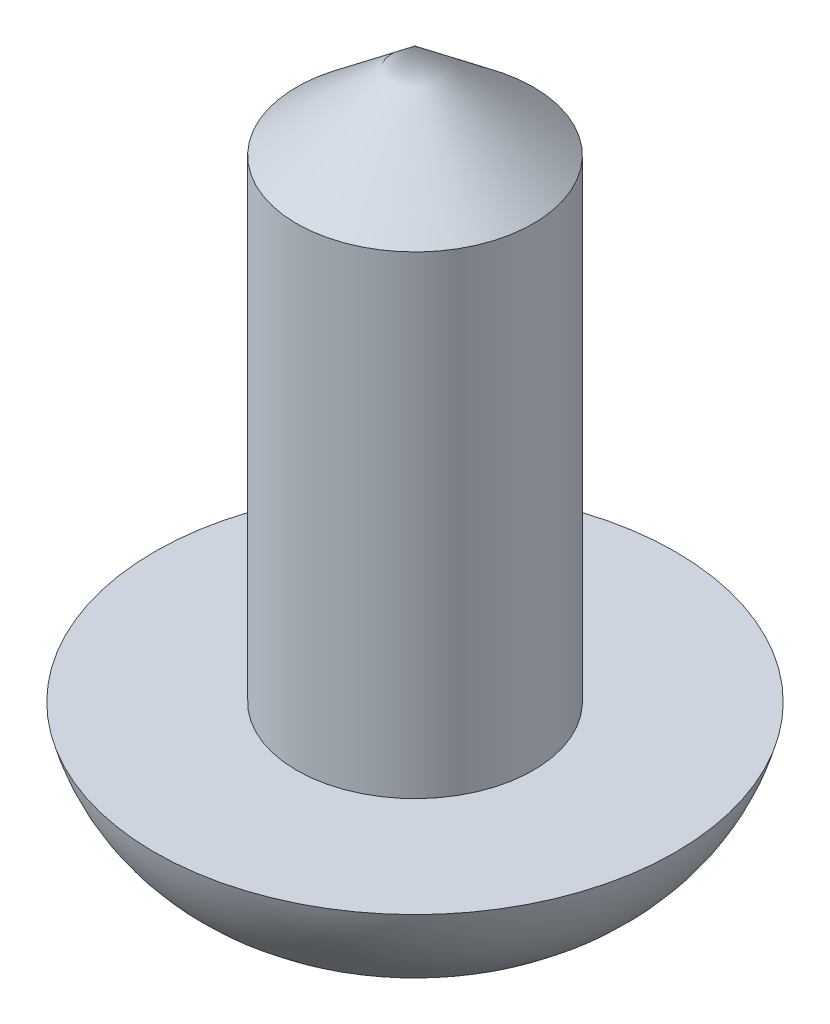
ISO-10303-21;
HEADER;
FILE_DESCRIPTION(('STEP AP214'),'2;1');
FILE_NAME('part.step','',(''),(''),'','','');
FILE_SCHEMA(('AUTOMOTIVE_DESIGN { 1 0 10303 214 1 1 1 1 }'));
ENDSEC;
DATA;
#1=APPLICATION_CONTEXT('core data for automotive mechanical design processes');
#2=APPLICATION_PROTOCOL_DEFINITION('international standard','automotive_design',2000,#1);
#3=PRODUCT_CONTEXT('',#1,'mechanical');
#4=PRODUCT('Part','Part','',(#3));
#5=PRODUCT_RELATED_PRODUCT_CATEGORY('part','',(#4));
#6=PRODUCT_DEFINITION_FORMATION('','',#4);
#7=PRODUCT_DEFINITION_CONTEXT('part definition',#1,'design');
#8=PRODUCT_DEFINITION('design','',#6,#7);
#9=PRODUCT_DEFINITION_SHAPE('','',#8);
#10=(LENGTH_UNIT() NAMED_UNIT(*) SI_UNIT(.MILLI.,.METRE.));
#11=(NAMED_UNIT(*) PLANE_ANGLE_UNIT() SI_UNIT($,.RADIAN.));
#12=(NAMED_UNIT(*) SI_UNIT($,.STERADIAN.) SOLID_ANGLE_UNIT());
#13=UNCERTAINTY_MEASURE_WITH_UNIT(LENGTH_MEASURE(1.E-05),#10,'distance_accuracy_value','');
#14=(GEOMETRIC_REPRESENTATION_CONTEXT(3) GLOBAL_UNCERTAINTY_ASSIGNED_CONTEXT((#13)) GLOBAL_UNIT_ASSIGNED_CONTEXT((#10,
#11,#12)) REPRESENTATION_CONTEXT('',''));
#15=CARTESIAN_POINT('',(0.,0.,0.));
#16=DIRECTION('',(0.,0.,1.));
#17=DIRECTION('',(1.,0.,0.));
#18=AXIS2_PLACEMENT_3D('',#15,#16,#17);
#19=CARTESIAN_POINT('',(0.,-1.5,0.));
#20=DIRECTION('',(0.,-1.,0.));
#21=DIRECTION('',(0.,0.,-1.));
#22=AXIS2_PLACEMENT_3D('',#19,#20,#21);
#23=PLANE('',#22);
#24=DIRECTION('',(0.,0.,1.));
#25=VECTOR('',#24,1.);
#26=CARTESIAN_POINT('',(0.375,-1.5,0.375));
#27=LINE('',#26,#25);
#28=CARTESIAN_POINT('',(0.375,-1.5,0.375));
#29=VERTEX_POINT('',#28);
#30=CARTESIAN_POINT('',(0.375,-1.5,0.72192160095789));
#31=VERTEX_POINT('',#30);
#32=EDGE_CURVE('E419',#29,#31,#27,.T.);
#33=ORIENTED_EDGE('',*,*,#32,.F.);
#34=DIRECTION('',(-1.,0.,0.));
#35=VECTOR('',#34,1.);
#36=CARTESIAN_POINT('',(0.375,-1.5,0.375));
#37=LINE('',#36,#35);
#38=CARTESIAN_POINT('',(0.72192160095789,-1.5,0.375));
#39=VERTEX_POINT('',#38);
#40=EDGE_CURVE('E216',#39,#29,#37,.T.);
#41=ORIENTED_EDGE('',*,*,#40,.F.);
#42=CARTESIAN_POINT('',(0.,-1.5,0.));
#43=DIRECTION('',(0.,-1.,0.));
#44=DIRECTION('',(0.,0.,-1.));
#45=AXIS2_PLACEMENT_3D('',#42,#43,#44);
#46=CIRCLE('',#45,0.813508326896291);
#47=EDGE_CURVE('E297',#39,#31,#46,.T.);
#48=ORIENTED_EDGE('',*,*,#47,.T.);
#49=EDGE_LOOP('',(#33,#41,#48));
#50=FACE_BOUND('',#49,.T.);
#51=ADVANCED_FACE('F38',(#50),#23,.T.);
#52=DIRECTION('',(1.,0.,0.));
#53=VECTOR('',#52,1.);
#54=CARTESIAN_POINT('',(0.375,-1.5,-0.375));
#55=LINE('',#54,#53);
#56=CARTESIAN_POINT('',(0.375,-1.5,-0.375));
#57=VERTEX_POINT('',#56);
#58=CARTESIAN_POINT('',(0.72192160095789,-1.5,-0.375));
#59=VERTEX_POINT('',#58);
#60=EDGE_CURVE('E209',#57,#59,#55,.T.);
#61=ORIENTED_EDGE('',*,*,#60,.F.);
#62=DIRECTION('',(0.,0.,1.));
#63=VECTOR('',#62,1.);
#64=CARTESIAN_POINT('',(0.375,-1.5,-1.5));
#65=LINE('',#64,#63);
#66=CARTESIAN_POINT('',(0.375,-1.5,-0.72192160095789));
#67=VERTEX_POINT('',#66);
#68=EDGE_CURVE('E207',#67,#57,#65,.T.);
#69=ORIENTED_EDGE('',*,*,#68,.F.);
#70=EDGE_CURVE('E293',#67,#59,#46,.T.);
#71=ORIENTED_EDGE('',*,*,#70,.T.);
#72=EDGE_LOOP('',(#61,#69,#71));
#73=FACE_BOUND('',#72,.T.);
#74=ADVANCED_FACE('F170',(#73),#23,.T.);
#75=DIRECTION('',(0.,0.,-1.));
#76=VECTOR('',#75,1.);
#77=CARTESIAN_POINT('',(-0.375,-1.5,-1.5));
#78=LINE('',#77,#76);
#79=CARTESIAN_POINT('',(-0.375,-1.5,-0.375));
#80=VERTEX_POINT('',#79);
#81=CARTESIAN_POINT('',(-0.375,-1.5,-0.72192160095789));
#82=VERTEX_POINT('',#81);
#83=EDGE_CURVE('E200',#80,#82,#78,.T.);
#84=ORIENTED_EDGE('',*,*,#83,.F.);
#85=DIRECTION('',(1.,0.,0.));
#86=VECTOR('',#85,1.);
#87=CARTESIAN_POINT('',(-1.5,-1.5,-0.375));
#88=LINE('',#87,#86);
#89=CARTESIAN_POINT('',(-0.72192160095789,-1.5,-0.375));
#90=VERTEX_POINT('',#89);
#91=EDGE_CURVE('E201',#90,#80,#88,.T.);
#92=ORIENTED_EDGE('',*,*,#91,.F.);
#93=EDGE_CURVE('E203',#90,#82,#46,.T.);
#94=ORIENTED_EDGE('',*,*,#93,.T.);
#95=EDGE_LOOP('',(#84,#92,#94));
#96=FACE_BOUND('',#95,.T.);
#97=ADVANCED_FACE('F178',(#96),#23,.T.);
#98=CARTESIAN_POINT('',(0.,5.,0.));
#99=DIRECTION('',(0.,-1.,0.));
#100=DIRECTION('',(0.,0.,-1.));
#101=AXIS2_PLACEMENT_3D('',#98,#99,#100);
#102=CYLINDRICAL_SURFACE('',#101,1.25);
#103=CARTESIAN_POINT('',(0.,5.,0.));
#104=DIRECTION('',(0.,1.,0.));
#105=DIRECTION('',(0.,0.,1.));
#106=AXIS2_PLACEMENT_3D('',#103,#104,#105);
#107=CIRCLE('',#106,1.25);
#108=CARTESIAN_POINT('',(0.,5.,1.25));
#109=VERTEX_POINT('',#108);
#110=EDGE_CURVE('E289',#109,#109,#107,.T.);
#111=ORIENTED_EDGE('',*,*,#110,.F.);
#112=EDGE_LOOP('',(#111));
#113=FACE_BOUND('',#112,.T.);
#114=CARTESIAN_POINT('',(0.,0.,0.));
#115=DIRECTION('',(0.,1.,0.));
#116=DIRECTION('',(0.,0.,1.));
#117=AXIS2_PLACEMENT_3D('',#114,#115,#116);
#118=CIRCLE('',#117,1.25);
#119=CARTESIAN_POINT('',(0.,0.,1.25));
#120=VERTEX_POINT('',#119);
#121=EDGE_CURVE('E288',#120,#120,#118,.T.);
#122=ORIENTED_EDGE('',*,*,#121,.T.);
#123=EDGE_LOOP('',(#122));
#124=FACE_BOUND('',#123,.T.);
#125=ADVANCED_FACE('F184',(#113,#124),#102,.T.);
#126=DIRECTION('',(-1.,0.,0.));
#127=VECTOR('',#126,1.);
#128=CARTESIAN_POINT('',(-1.5,-1.5,0.375));
#129=LINE('',#128,#127);
#130=CARTESIAN_POINT('',(-0.375,-1.5,0.375));
#131=VERTEX_POINT('',#130);
#132=CARTESIAN_POINT('',(-0.72192160095789,-1.5,0.375));
#133=VERTEX_POINT('',#132);
#134=EDGE_CURVE('E211',#131,#133,#129,.T.);
#135=ORIENTED_EDGE('',*,*,#134,.F.);
#136=DIRECTION('',(0.,0.,-1.));
#137=VECTOR('',#136,1.);
#138=CARTESIAN_POINT('',(-0.375,-1.5,0.375));
#139=LINE('',#138,#137);
#140=CARTESIAN_POINT('',(-0.375,-1.5,0.72192160095789));
#141=VERTEX_POINT('',#140);
#142=EDGE_CURVE('E427',#141,#131,#139,.T.);
#143=ORIENTED_EDGE('',*,*,#142,.F.);
#144=EDGE_CURVE('E423',#141,#133,#46,.T.);
#145=ORIENTED_EDGE('',*,*,#144,.T.);
#146=EDGE_LOOP('',(#135,#143,#145));
#147=FACE_BOUND('',#146,.T.);
#148=ADVANCED_FACE('F173',(#147),#23,.T.);
#149=CARTESIAN_POINT('',(0.,0.,0.));
#150=DIRECTION('',(0.,-1.,0.));
#151=DIRECTION('',(0.,0.,-1.));
#152=AXIS2_PLACEMENT_3D('',#149,#150,#151);
#153=PLANE('',#152);
#154=ORIENTED_EDGE('',*,*,#121,.F.);
#155=EDGE_LOOP('',(#154));
#156=FACE_BOUND('',#155,.T.);
#157=CARTESIAN_POINT('',(0.,0.,0.));
#158=DIRECTION('',(0.,-1.,0.));
#159=DIRECTION('',(0.,0.,-1.));
#160=AXIS2_PLACEMENT_3D('',#157,#158,#159);
#161=CIRCLE('',#160,2.75);
#162=CARTESIAN_POINT('',(0.,0.,-2.75));
#163=VERTEX_POINT('',#162);
#164=EDGE_CURVE('E222',#163,#163,#161,.T.);
#165=ORIENTED_EDGE('',*,*,#164,.F.);
#166=EDGE_LOOP('',(#165));
#167=FACE_BOUND('',#166,.T.);
#168=ADVANCED_FACE('F183',(#156,#167),#153,.F.);
#169=CARTESIAN_POINT('',(0.,0.5,0.));
#170=DIRECTION('',(0.,1.,0.));
#171=DIRECTION('',(0.,0.,1.));
#172=AXIS2_PLACEMENT_3D('',#169,#170,#171);
#173=DEGENERATE_TOROIDAL_SURFACE('',#172,0.813508326896291,2.,.T.);
#174=CARTESIAN_POINT('',(1.5002,-1.36418887532434,0.338609518819995));
#175=CARTESIAN_POINT('',(1.44468048600186,-1.38477581197695,0.344125771870693));
#176=CARTESIAN_POINT('',(1.38824093225275,-1.40302607729678,0.349015915724794));
#177=CARTESIAN_POINT('',(1.27392842131462,-1.43483166733049,0.357538197889121));
#178=CARTESIAN_POINT('',(1.21605473891789,-1.44838456254277,0.361169685216356));
#179=CARTESIAN_POINT('',(1.10036366181757,-1.4705560966838,0.367110529884403));
#180=CARTESIAN_POINT('',(1.04256312440993,-1.47925720240618,0.369441984135974));
#181=CARTESIAN_POINT('',(0.926473924007673,-1.49216293465133,0.372900064668793));
#182=CARTESIAN_POINT('',(0.86818564668057,-1.49637082748226,0.374027566154678));
#183=CARTESIAN_POINT('',(0.751652989588427,-1.50052024778491,0.37513939997383));
#184=CARTESIAN_POINT('',(0.693409130537497,-1.50047618592187,0.375127593633212));
#185=CARTESIAN_POINT('',(0.57699942054303,-1.49662961962801,0.374096909301138));
#186=CARTESIAN_POINT('',(0.518833754490701,-1.49282247839674,0.37307678888275));
#187=CARTESIAN_POINT('',(0.431230241930394,-1.48508860253394,0.37100450309095));
#188=CARTESIAN_POINT('',(0.401690256799903,-1.48213577717559,0.37021329592079));
#189=CARTESIAN_POINT('',(0.342654386936952,-1.47583805796826,0.368525827145029));
#190=CARTESIAN_POINT('',(0.313158504786035,-1.47249314201341,0.367629559616175));
#191=CARTESIAN_POINT('',(0.25424072980344,-1.46583499833817,0.365845515395305));
#192=CARTESIAN_POINT('',(0.22481884974444,-1.46252170984735,0.364957722419897));
#193=CARTESIAN_POINT('',(0.165903889188904,-1.45655738425792,0.363359586194815));
#194=CARTESIAN_POINT('',(0.136410804181315,-1.45390639029179,0.36264925450245));
#195=CARTESIAN_POINT('',(0.106850807568926,-1.45190661541983,0.362113416440465));
#196=B_SPLINE_CURVE_WITH_KNOTS('',3,(#174,#175,#176,#177,#178,#179,#180,#181,#182,#183,#184,
#185,#186,#187,#188,#189,#190,#191,#192,#193,#194,#195),.UNSPECIFIED.,.F.,.F.,(4,2,2,2,2,2,2,2,
2,2,4),(0.,0.178342716214759,0.356777534944978,0.532079024757146,0.70725299350022,
0.881833286004919,1.05662896178889,1.1457196693411,1.23481540220137,1.32367319509826,
1.4125367734229),.UNSPECIFIED.);
#197=CARTESIAN_POINT('',(1.46683730392551,-1.37623513333405,0.341837303925514));
#198=VERTEX_POINT('',#197);
#199=EDGE_CURVE('E11',#198,#39,#196,.T.);
#200=ORIENTED_EDGE('',*,*,#199,.F.);
#201=CARTESIAN_POINT('',(1.46611845673933,-1.37355235911233,-0.37519999999995));
#202=CARTESIAN_POINT('',(1.46752528263332,-1.37880270482613,-0.312764643826198));
#203=CARTESIAN_POINT('',(1.4685665257894,-1.38268867718762,-0.250212705410789));
#204=CARTESIAN_POINT('',(1.46994371674215,-1.38782842379504,-0.125107035895684));
#205=CARTESIAN_POINT('',(1.47028095293069,-1.3890870063848,-0.0625535179478422));
#206=CARTESIAN_POINT('',(1.47028095293069,-1.3890870063848,0.0625535179478414));
#207=CARTESIAN_POINT('',(1.46994371674215,-1.38782842379504,0.125107035895683));
#208=CARTESIAN_POINT('',(1.4685665257894,-1.38268867718762,0.250212705410788));
#209=CARTESIAN_POINT('',(1.46752528263332,-1.37880270482613,0.312764643826197));
#210=CARTESIAN_POINT('',(1.46611845673933,-1.37355235911233,0.375199999999949));
#211=B_SPLINE_CURVE_WITH_KNOTS('',3,(#201,#202,#203,#204,#205,#206,#207,#208,#209,#210),
.UNSPECIFIED.,.F.,.F.,(4,2,2,2,4),(0.,0.18798867974028,0.375633021731535,0.56327736372279,
0.75126604346307),.UNSPECIFIED.);
#212=CARTESIAN_POINT('',(1.46683730392552,-1.37623513333406,-0.341837303925515));
#213=VERTEX_POINT('',#212);
#214=EDGE_CURVE('E52',#213,#198,#211,.T.);
#215=ORIENTED_EDGE('',*,*,#214,.F.);
#216=CARTESIAN_POINT('',(0.106850807568926,-1.45190661541983,-0.362113416440465));
#217=CARTESIAN_POINT('',(0.138522323038607,-1.45405643298903,-0.362689458322004));
#218=CARTESIAN_POINT('',(0.170116284613483,-1.45694381202987,-0.363463129204241));
#219=CARTESIAN_POINT('',(0.233223394914039,-1.463425187812,-0.365199808610906));
#220=CARTESIAN_POINT('',(0.264736558009145,-1.46701904859034,-0.366162780704173));
#221=CARTESIAN_POINT('',(0.328031854251723,-1.47417608010015,-0.36808050151743));
#222=CARTESIAN_POINT('',(0.359814034382478,-1.47773874338365,-0.369035114267147));
#223=CARTESIAN_POINT('',(0.423443467189695,-1.48432522117286,-0.37079995567173));
#224=CARTESIAN_POINT('',(0.455290727581239,-1.48734896753299,-0.371610166067044));
#225=CARTESIAN_POINT('',(0.551898061636979,-1.49519530403346,-0.373712585595889));
#226=CARTESIAN_POINT('',(0.61679130562626,-1.49866548494446,-0.374642417768581));
#227=CARTESIAN_POINT('',(0.746691924857555,-1.50070517288039,-0.375188950503825));
#228=CARTESIAN_POINT('',(0.811699315156484,-1.49927397579783,-0.374805462401345));
#229=CARTESIAN_POINT('',(0.940942883850035,-1.49103050163164,-0.372596630155685));
#230=CARTESIAN_POINT('',(1.00518133996513,-1.48425226729482,-0.370780407739025));
#231=CARTESIAN_POINT('',(1.13276511840539,-1.46514934966744,-0.365661796387692));
#232=CARTESIAN_POINT('',(1.19611065751612,-1.45282603741177,-0.362359774820709));
#233=CARTESIAN_POINT('',(1.29962206980089,-1.42785166924072,-0.355667913037796));
#234=CARTESIAN_POINT('',(1.34020749101022,-1.41679664921707,-0.352705729350152));
#235=CARTESIAN_POINT('',(1.42075031493157,-1.39228826134489,-0.34613872661201));
#236=CARTESIAN_POINT('',(1.46070502805401,-1.3788266490755,-0.342531698475609));
#237=CARTESIAN_POINT('',(1.5002,-1.36418887532435,-0.338609518819998));
#238=B_SPLINE_CURVE_WITH_KNOTS('',3,(#216,#217,#218,#219,#220,#221,#222,#223,#224,#225,#226,
#227,#228,#229,#230,#231,#232,#233,#234,#235,#236,#237),.UNSPECIFIED.,.F.,.F.,(4,2,2,2,2,2,2,2,
2,2,4),(0.,0.0952085753199255,0.190398845582843,0.286384597850533,0.382382478835967,
0.577200204729359,0.772045918338507,0.965661031443078,1.15922829899204,1.28566105855344,
1.41253554986182),.UNSPECIFIED.);
#239=EDGE_CURVE('E388',#59,#213,#238,.T.);
#240=ORIENTED_EDGE('',*,*,#239,.F.);
#241=ORIENTED_EDGE('',*,*,#70,.F.);
#242=CARTESIAN_POINT('',(0.338609518819995,-1.36418887532434,-1.5002));
#243=CARTESIAN_POINT('',(0.344125771870693,-1.38477581197695,-1.44468048600186));
#244=CARTESIAN_POINT('',(0.349015915724794,-1.40302607729678,-1.38824093225275));
#245=CARTESIAN_POINT('',(0.357538197889122,-1.43483166733049,-1.27392842131462));
#246=CARTESIAN_POINT('',(0.361169685216356,-1.44838456254277,-1.21605473891788));
#247=CARTESIAN_POINT('',(0.367110529884403,-1.4705560966838,-1.10036366181757));
#248=CARTESIAN_POINT('',(0.369441984135974,-1.47925720240618,-1.04256312440993));
#249=CARTESIAN_POINT('',(0.372900064668794,-1.49216293465133,-0.926473924007672));
#250=CARTESIAN_POINT('',(0.374027566154678,-1.49637082748226,-0.86818564668057));
#251=CARTESIAN_POINT('',(0.37513939997383,-1.50052024778491,-0.751652989588427));
#252=CARTESIAN_POINT('',(0.375127593633212,-1.50047618592187,-0.693409130537496));
#253=CARTESIAN_POINT('',(0.374096909301139,-1.49662961962801,-0.57699942054303));
#254=CARTESIAN_POINT('',(0.37307678888275,-1.49282247839674,-0.518833754490701));
#255=CARTESIAN_POINT('',(0.37100450309095,-1.48508860253394,-0.431230241930394));
#256=CARTESIAN_POINT('',(0.370213295920791,-1.48213577717559,-0.401690256799903));
#257=CARTESIAN_POINT('',(0.368525827145029,-1.47583805796826,-0.342654386936952));
#258=CARTESIAN_POINT('',(0.367629559616175,-1.47249314201341,-0.313158504786035));
#259=CARTESIAN_POINT('',(0.365845515395306,-1.46583499833817,-0.25424072980344));
#260=CARTESIAN_POINT('',(0.364957722419898,-1.46252170984735,-0.22481884974444));
#261=CARTESIAN_POINT('',(0.363359586194815,-1.45655738425792,-0.165903889188904));
#262=CARTESIAN_POINT('',(0.36264925450245,-1.45390639029179,-0.136410804181315));
#263=CARTESIAN_POINT('',(0.362113416440465,-1.45190661541983,-0.106850807568926));
#264=B_SPLINE_CURVE_WITH_KNOTS('',3,(#242,#243,#244,#245,#246,#247,#248,#249,#250,#251,#252,
#253,#254,#255,#256,#257,#258,#259,#260,#261,#262,#263),.UNSPECIFIED.,.F.,.F.,(4,2,2,2,2,2,2,2,
2,2,4),(0.,0.178342716214759,0.356777534944979,0.532079024757147,0.70725299350022,
0.881833286004919,1.05662896178889,1.1457196693411,1.23481540220137,1.32367319509826,
1.4125367734229),.UNSPECIFIED.);
#265=CARTESIAN_POINT('',(0.341837303925514,-1.37623513333405,-1.46683730392551));
#266=VERTEX_POINT('',#265);
#267=EDGE_CURVE('E382',#266,#67,#264,.T.);
#268=ORIENTED_EDGE('',*,*,#267,.F.);
#269=CARTESIAN_POINT('',(-0.37519999999995,-1.37355235911233,-1.46611845673933));
#270=CARTESIAN_POINT('',(-0.312764643826198,-1.37880270482613,-1.46752528263332));
#271=CARTESIAN_POINT('',(-0.250212705410789,-1.38268867718762,-1.4685665257894));
#272=CARTESIAN_POINT('',(-0.125107035895684,-1.38782842379504,-1.46994371674215));
#273=CARTESIAN_POINT('',(-0.062553517947842,-1.3890870063848,-1.47028095293069));
#274=CARTESIAN_POINT('',(0.0625535179478416,-1.3890870063848,-1.47028095293069));
#275=CARTESIAN_POINT('',(0.125107035895683,-1.38782842379504,-1.46994371674215));
#276=CARTESIAN_POINT('',(0.250212705410789,-1.38268867718762,-1.4685665257894));
#277=CARTESIAN_POINT('',(0.312764643826198,-1.37880270482613,-1.46752528263332));
#278=CARTESIAN_POINT('',(0.37519999999995,-1.37355235911233,-1.46611845673933));
#279=B_SPLINE_CURVE_WITH_KNOTS('',3,(#269,#270,#271,#272,#273,#274,#275,#276,#277,#278),
.UNSPECIFIED.,.F.,.F.,(4,2,2,2,4),(0.,0.18798867974028,0.375633021731535,0.56327736372279,
0.75126604346307),.UNSPECIFIED.);
#280=CARTESIAN_POINT('',(-0.341837303925515,-1.37623513333406,-1.46683730392552));
#281=VERTEX_POINT('',#280);
#282=EDGE_CURVE('E376',#281,#266,#279,.T.);
#283=ORIENTED_EDGE('',*,*,#282,.F.);
#284=CARTESIAN_POINT('',(-0.362113416440465,-1.45190661541983,-0.106850807568926));
#285=CARTESIAN_POINT('',(-0.362689458322004,-1.45405643298903,-0.138522323038607));
#286=CARTESIAN_POINT('',(-0.363463129204241,-1.45694381202987,-0.170116284613484));
#287=CARTESIAN_POINT('',(-0.365199808610907,-1.463425187812,-0.233223394914039));
#288=CARTESIAN_POINT('',(-0.366162780704173,-1.46701904859034,-0.264736558009145));
#289=CARTESIAN_POINT('',(-0.36808050151743,-1.47417608010015,-0.328031854251724));
#290=CARTESIAN_POINT('',(-0.369035114267147,-1.47773874338365,-0.359814034382478));
#291=CARTESIAN_POINT('',(-0.37079995567173,-1.48432522117286,-0.423443467189696));
#292=CARTESIAN_POINT('',(-0.371610166067044,-1.48734896753299,-0.455290727581239));
#293=CARTESIAN_POINT('',(-0.373712585595889,-1.49519530403346,-0.551898061636979));
#294=CARTESIAN_POINT('',(-0.37464241776858,-1.49866548494446,-0.61679130562626));
#295=CARTESIAN_POINT('',(-0.375188950503825,-1.50070517288039,-0.746691924857556));
#296=CARTESIAN_POINT('',(-0.374805462401345,-1.49927397579783,-0.811699315156484));
#297=CARTESIAN_POINT('',(-0.372596630155685,-1.49103050163164,-0.940942883850035));
#298=CARTESIAN_POINT('',(-0.370780407739025,-1.48425226729482,-1.00518133996513));
#299=CARTESIAN_POINT('',(-0.365661796387692,-1.46514934966744,-1.13276511840539));
#300=CARTESIAN_POINT('',(-0.362359774820708,-1.45282603741177,-1.19611065751613));
#301=CARTESIAN_POINT('',(-0.355667913037796,-1.42785166924072,-1.29962206980089));
#302=CARTESIAN_POINT('',(-0.352705729350151,-1.41679664921707,-1.34020749101022));
#303=CARTESIAN_POINT('',(-0.34613872661201,-1.39228826134489,-1.42075031493157));
#304=CARTESIAN_POINT('',(-0.342531698475608,-1.3788266490755,-1.46070502805401));
#305=CARTESIAN_POINT('',(-0.338609518819998,-1.36418887532435,-1.5002));
#306=B_SPLINE_CURVE_WITH_KNOTS('',3,(#284,#285,#286,#287,#288,#289,#290,#291,#292,#293,#294,
#295,#296,#297,#298,#299,#300,#301,#302,#303,#304,#305),.UNSPECIFIED.,.F.,.F.,(4,2,2,2,2,2,2,2,
2,2,4),(0.,0.0952085753199257,0.190398845582844,0.286384597850533,0.382382478835967,
0.577200204729359,0.772045918338507,0.965661031443078,1.15922829899204,1.28566105855344,
1.41253554986182),.UNSPECIFIED.);
#307=EDGE_CURVE('E353',#82,#281,#306,.T.);
#308=ORIENTED_EDGE('',*,*,#307,.F.);
#309=ORIENTED_EDGE('',*,*,#93,.F.);
#310=CARTESIAN_POINT('',(-1.5002,-1.36418887532434,-0.338609518819996));
#311=CARTESIAN_POINT('',(-1.44468048600186,-1.38477581197695,-0.344125771870693));
#312=CARTESIAN_POINT('',(-1.38824093225275,-1.40302607729678,-0.349015915724795));
#313=CARTESIAN_POINT('',(-1.27392842131462,-1.43483166733049,-0.357538197889122));
#314=CARTESIAN_POINT('',(-1.21605473891788,-1.44838456254277,-0.361169685216357));
#315=CARTESIAN_POINT('',(-1.10036366181756,-1.4705560966838,-0.367110529884403));
#316=CARTESIAN_POINT('',(-1.04256312440993,-1.47925720240618,-0.369441984135974));
#317=CARTESIAN_POINT('',(-0.926473924007672,-1.49216293465133,-0.372900064668794));
#318=CARTESIAN_POINT('',(-0.86818564668057,-1.49637082748226,-0.374027566154678));
#319=CARTESIAN_POINT('',(-0.751652989588426,-1.50052024778491,-0.37513939997383));
#320=CARTESIAN_POINT('',(-0.693409130537496,-1.50047618592187,-0.375127593633212));
#321=CARTESIAN_POINT('',(-0.57699942054303,-1.49662961962801,-0.374096909301139));
#322=CARTESIAN_POINT('',(-0.518833754490701,-1.49282247839674,-0.373076788882751));
#323=CARTESIAN_POINT('',(-0.431230241930394,-1.48508860253394,-0.37100450309095));
#324=CARTESIAN_POINT('',(-0.401690256799903,-1.48213577717559,-0.370213295920791));
#325=CARTESIAN_POINT('',(-0.342654386936952,-1.47583805796826,-0.368525827145029));
#326=CARTESIAN_POINT('',(-0.313158504786035,-1.47249314201341,-0.367629559616175));
#327=CARTESIAN_POINT('',(-0.25424072980344,-1.46583499833818,-0.365845515395306));
#328=CARTESIAN_POINT('',(-0.22481884974444,-1.46252170984735,-0.364957722419898));
#329=CARTESIAN_POINT('',(-0.165903889188904,-1.45655738425792,-0.363359586194815));
#330=CARTESIAN_POINT('',(-0.136410804181315,-1.45390639029179,-0.362649254502451));
#331=CARTESIAN_POINT('',(-0.106850807568926,-1.45190661541983,-0.362113416440465));
#332=B_SPLINE_CURVE_WITH_KNOTS('',3,(#310,#311,#312,#313,#314,#315,#316,#317,#318,#319,#320,
#321,#322,#323,#324,#325,#326,#327,#328,#329,#330,#331),.UNSPECIFIED.,.F.,.F.,(4,2,2,2,2,2,2,2,
2,2,4),(0.,0.178342716214759,0.356777534944979,0.532079024757146,0.70725299350022,
0.881833286004918,1.05662896178889,1.1457196693411,1.23481540220137,1.32367319509826,
1.4125367734229),.UNSPECIFIED.);
#333=CARTESIAN_POINT('',(-1.46683730392551,-1.37623513333405,-0.341837303925515));
#334=VERTEX_POINT('',#333);
#335=EDGE_CURVE('E347',#334,#90,#332,.T.);
#336=ORIENTED_EDGE('',*,*,#335,.F.);
#337=CARTESIAN_POINT('',(-1.46611845673933,-1.37355235911233,0.375199999999949));
#338=CARTESIAN_POINT('',(-1.46752528263332,-1.37880270482613,0.312764643826198));
#339=CARTESIAN_POINT('',(-1.46856652578939,-1.38268867718762,0.250212705410789));
#340=CARTESIAN_POINT('',(-1.46994371674215,-1.38782842379504,0.125107035895683));
#341=CARTESIAN_POINT('',(-1.47028095293069,-1.3890870063848,0.0625535179478415));
#342=CARTESIAN_POINT('',(-1.47028095293069,-1.3890870063848,-0.0625535179478421));
#343=CARTESIAN_POINT('',(-1.46994371674215,-1.38782842379504,-0.125107035895684));
#344=CARTESIAN_POINT('',(-1.46856652578939,-1.38268867718762,-0.250212705410789));
#345=CARTESIAN_POINT('',(-1.46752528263332,-1.37880270482613,-0.312764643826198));
#346=CARTESIAN_POINT('',(-1.46611845673933,-1.37355235911233,-0.37519999999995));
#347=B_SPLINE_CURVE_WITH_KNOTS('',3,(#337,#338,#339,#340,#341,#342,#343,#344,#345,#346),
.UNSPECIFIED.,.F.,.F.,(4,2,2,2,4),(0.,0.18798867974028,0.375633021731535,0.56327736372279,
0.75126604346307),.UNSPECIFIED.);
#348=CARTESIAN_POINT('',(-1.46683730392551,-1.37623513333406,0.341837303925514));
#349=VERTEX_POINT('',#348);
#350=EDGE_CURVE('E336',#349,#334,#347,.T.);
#351=ORIENTED_EDGE('',*,*,#350,.F.);
#352=CARTESIAN_POINT('',(-0.106850807568926,-1.45190661541983,0.362113416440464));
#353=CARTESIAN_POINT('',(-0.138522323038607,-1.45405643298903,0.362689458322004));
#354=CARTESIAN_POINT('',(-0.170116284613483,-1.45694381202987,0.36346312920424));
#355=CARTESIAN_POINT('',(-0.233223394914039,-1.463425187812,0.365199808610906));
#356=CARTESIAN_POINT('',(-0.264736558009145,-1.46701904859034,0.366162780704172));
#357=CARTESIAN_POINT('',(-0.328031854251723,-1.47417608010015,0.368080501517429));
#358=CARTESIAN_POINT('',(-0.359814034382477,-1.47773874338365,0.369035114267146));
#359=CARTESIAN_POINT('',(-0.423443467189695,-1.48432522117286,0.37079995567173));
#360=CARTESIAN_POINT('',(-0.455290727581238,-1.48734896753299,0.371610166067044));
#361=CARTESIAN_POINT('',(-0.551898061636978,-1.49519530403346,0.373712585595889));
#362=CARTESIAN_POINT('',(-0.616791305626259,-1.49866548494446,0.37464241776858));
#363=CARTESIAN_POINT('',(-0.746691924857554,-1.50070517288039,0.375188950503824));
#364=CARTESIAN_POINT('',(-0.811699315156483,-1.49927397579783,0.374805462401344));
#365=CARTESIAN_POINT('',(-0.940942883850033,-1.49103050163164,0.372596630155684));
#366=CARTESIAN_POINT('',(-1.00518133996513,-1.48425226729482,0.370780407739025));
#367=CARTESIAN_POINT('',(-1.13276511840539,-1.46514934966744,0.365661796387692));
#368=CARTESIAN_POINT('',(-1.19611065751612,-1.45282603741177,0.362359774820708));
#369=CARTESIAN_POINT('',(-1.29962206980089,-1.42785166924072,0.355667913037796));
#370=CARTESIAN_POINT('',(-1.34020749101022,-1.41679664921707,0.352705729350151));
#371=CARTESIAN_POINT('',(-1.42075031493157,-1.39228826134489,0.34613872661201));
#372=CARTESIAN_POINT('',(-1.46070502805401,-1.37882664907551,0.342531698475608));
#373=CARTESIAN_POINT('',(-1.5002,-1.36418887532435,0.338609518819997));
#374=B_SPLINE_CURVE_WITH_KNOTS('',3,(#352,#353,#354,#355,#356,#357,#358,#359,#360,#361,#362,
#363,#364,#365,#366,#367,#368,#369,#370,#371,#372,#373),.UNSPECIFIED.,.F.,.F.,(4,2,2,2,2,2,2,2,
2,2,4),(0.,0.0952085753199254,0.190398845582843,0.286384597850532,0.382382478835966,
0.577200204729358,0.772045918338506,0.965661031443076,1.15922829899203,1.28566105855344,
1.41253554986182),.UNSPECIFIED.);
#375=EDGE_CURVE('E330',#133,#349,#374,.T.);
#376=ORIENTED_EDGE('',*,*,#375,.F.);
#377=ORIENTED_EDGE('',*,*,#144,.F.);
#378=CARTESIAN_POINT('',(-0.338609518819995,-1.36418887532434,1.5002));
#379=CARTESIAN_POINT('',(-0.344125771870693,-1.38477581197695,1.44468048600186));
#380=CARTESIAN_POINT('',(-0.349015915724795,-1.40302607729678,1.38824093225275));
#381=CARTESIAN_POINT('',(-0.357538197889122,-1.43483166733049,1.27392842131462));
#382=CARTESIAN_POINT('',(-0.361169685216356,-1.44838456254277,1.21605473891788));
#383=CARTESIAN_POINT('',(-0.367110529884403,-1.4705560966838,1.10036366181756));
#384=CARTESIAN_POINT('',(-0.369441984135974,-1.47925720240618,1.04256312440993));
#385=CARTESIAN_POINT('',(-0.372900064668794,-1.49216293465133,0.926473924007671));
#386=CARTESIAN_POINT('',(-0.374027566154678,-1.49637082748226,0.868185646680569));
#387=CARTESIAN_POINT('',(-0.37513939997383,-1.50052024778491,0.751652989588426));
#388=CARTESIAN_POINT('',(-0.375127593633212,-1.50047618592187,0.693409130537496));
#389=CARTESIAN_POINT('',(-0.374096909301139,-1.49662961962801,0.576999420543029));
#390=CARTESIAN_POINT('',(-0.37307678888275,-1.49282247839674,0.5188337544907));
#391=CARTESIAN_POINT('',(-0.37100450309095,-1.48508860253394,0.431230241930393));
#392=CARTESIAN_POINT('',(-0.370213295920791,-1.48213577717559,0.401690256799902));
#393=CARTESIAN_POINT('',(-0.368525827145029,-1.47583805796826,0.342654386936951));
#394=CARTESIAN_POINT('',(-0.367629559616175,-1.47249314201341,0.313158504786034));
#395=CARTESIAN_POINT('',(-0.365845515395306,-1.46583499833817,0.254240729803439));
#396=CARTESIAN_POINT('',(-0.364957722419898,-1.46252170984735,0.224818849744439));
#397=CARTESIAN_POINT('',(-0.363359586194815,-1.45655738425792,0.165903889188903));
#398=CARTESIAN_POINT('',(-0.36264925450245,-1.45390639029179,0.136410804181314));
#399=CARTESIAN_POINT('',(-0.362113416440465,-1.45190661541983,0.106850807568926));
#400=B_SPLINE_CURVE_WITH_KNOTS('',3,(#378,#379,#380,#381,#382,#383,#384,#385,#386,#387,#388,
#389,#390,#391,#392,#393,#394,#395,#396,#397,#398,#399),.UNSPECIFIED.,.F.,.F.,(4,2,2,2,2,2,2,2,
2,2,4),(0.,0.178342716214759,0.356777534944979,0.532079024757147,0.70725299350022,
0.881833286004919,1.05662896178889,1.1457196693411,1.23481540220137,1.32367319509826,
1.4125367734229),.UNSPECIFIED.);
#401=CARTESIAN_POINT('',(-0.341837303925514,-1.37623513333405,1.46683730392551));
#402=VERTEX_POINT('',#401);
#403=EDGE_CURVE('E304',#402,#141,#400,.T.);
#404=ORIENTED_EDGE('',*,*,#403,.F.);
#405=CARTESIAN_POINT('',(0.37519999999995,-1.37355235911233,1.46611845673933));
#406=CARTESIAN_POINT('',(0.312764643826198,-1.37880270482613,1.46752528263332));
#407=CARTESIAN_POINT('',(0.250212705410789,-1.38268867718762,1.46856652578939));
#408=CARTESIAN_POINT('',(0.125107035895684,-1.38782842379504,1.46994371674215));
#409=CARTESIAN_POINT('',(0.0625535179478418,-1.3890870063848,1.47028095293069));
#410=CARTESIAN_POINT('',(-0.0625535179478418,-1.3890870063848,1.47028095293069));
#411=CARTESIAN_POINT('',(-0.125107035895684,-1.38782842379504,1.46994371674215));
#412=CARTESIAN_POINT('',(-0.250212705410789,-1.38268867718762,1.46856652578939));
#413=CARTESIAN_POINT('',(-0.312764643826198,-1.37880270482613,1.46752528263332));
#414=CARTESIAN_POINT('',(-0.37519999999995,-1.37355235911233,1.46611845673933));
#415=B_SPLINE_CURVE_WITH_KNOTS('',3,(#405,#406,#407,#408,#409,#410,#411,#412,#413,#414),
.UNSPECIFIED.,.F.,.F.,(4,2,2,2,4),(0.,0.18798867974028,0.375633021731535,0.56327736372279,
0.75126604346307),.UNSPECIFIED.);
#416=CARTESIAN_POINT('',(0.341837303925497,-1.37623513333406,1.46683730392551));
#417=VERTEX_POINT('',#416);
#418=EDGE_CURVE('E296',#417,#402,#415,.T.);
#419=ORIENTED_EDGE('',*,*,#418,.F.);
#420=CARTESIAN_POINT('',(0.362113416440465,-1.45190661541983,0.106850807568926));
#421=CARTESIAN_POINT('',(0.362689458322004,-1.45405643298903,0.138522323038606));
#422=CARTESIAN_POINT('',(0.36346312920424,-1.45694381202987,0.170116284613483));
#423=CARTESIAN_POINT('',(0.365199808610906,-1.463425187812,0.233223394914039));
#424=CARTESIAN_POINT('',(0.366162780704172,-1.46701904859034,0.264736558009145));
#425=CARTESIAN_POINT('',(0.368080501517429,-1.47417608010015,0.328031854251723));
#426=CARTESIAN_POINT('',(0.369035114267146,-1.47773874338365,0.359814034382477));
#427=CARTESIAN_POINT('',(0.37079995567173,-1.48432522117286,0.423443467189695));
#428=CARTESIAN_POINT('',(0.371610166067044,-1.48734896753299,0.455290727581238));
#429=CARTESIAN_POINT('',(0.373712585595889,-1.49519530403346,0.551898061636978));
#430=CARTESIAN_POINT('',(0.37464241776858,-1.49866548494446,0.616791305626259));
#431=CARTESIAN_POINT('',(0.375188950503825,-1.50070517288039,0.746691924857554));
#432=CARTESIAN_POINT('',(0.374805462401344,-1.49927397579784,0.811699315156483));
#433=CARTESIAN_POINT('',(0.372596630155685,-1.49103050163164,0.940942883850033));
#434=CARTESIAN_POINT('',(0.370780407739025,-1.48425226729482,1.00518133996513));
#435=CARTESIAN_POINT('',(0.365661796387692,-1.46514934966744,1.13276511840539));
#436=CARTESIAN_POINT('',(0.362359774820708,-1.45282603741177,1.19611065751612));
#437=CARTESIAN_POINT('',(0.355667913037796,-1.42785166924072,1.29962206980089));
#438=CARTESIAN_POINT('',(0.352705729350151,-1.41679664921707,1.34020749101022));
#439=CARTESIAN_POINT('',(0.34613872661201,-1.39228826134489,1.42075031493157));
#440=CARTESIAN_POINT('',(0.342531698475608,-1.3788266490755,1.46070502805401));
#441=CARTESIAN_POINT('',(0.338609518819997,-1.36418887532435,1.5002));
#442=B_SPLINE_CURVE_WITH_KNOTS('',3,(#420,#421,#422,#423,#424,#425,#426,#427,#428,#429,#430,
#431,#432,#433,#434,#435,#436,#437,#438,#439,#440,#441),.UNSPECIFIED.,.F.,.F.,(4,2,2,2,2,2,2,2,
2,2,4),(0.,0.0952085753199257,0.190398845582844,0.286384597850533,0.382382478835967,
0.577200204729358,0.772045918338506,0.965661031443076,1.15922829899204,1.28566105855344,
1.41253554986182),.UNSPECIFIED.);
#443=EDGE_CURVE('E337',#31,#417,#442,.T.);
#444=ORIENTED_EDGE('',*,*,#443,.F.);
#445=ORIENTED_EDGE('',*,*,#47,.F.);
#446=EDGE_LOOP('',(#200,#215,#240,#241,#268,#283,#308,#309,#336,#351,#376,#377,#404,#419,#444,#445));
#447=FACE_BOUND('',#446,.T.);
#448=ORIENTED_EDGE('',*,*,#164,.T.);
#449=EDGE_LOOP('',(#448));
#450=FACE_BOUND('',#449,.T.);
#451=ADVANCED_FACE('F40',(#447,#450),#173,.T.);
#452=CARTESIAN_POINT('',(0.375,-1.5,0.375));
#453=DIRECTION('',(0.965925826289068,0.258819045102521,0.));
#454=DIRECTION('',(-0.258819045102521,0.965925826289068,0.));
#455=AXIS2_PLACEMENT_3D('',#452,#453,#454);
#456=PLANE('',#455);
#457=ORIENTED_EDGE('',*,*,#443,.T.);
#458=DIRECTION('',(0.250562807085732,-0.935113126531029,0.250562807085732));
#459=VECTOR('',#458,1.);
#460=CARTESIAN_POINT('',(0.304370564668483,-1.23640735883288,1.42937056466848));
#461=LINE('',#460,#459);
#462=CARTESIAN_POINT('',(0.107050807568877,-0.5,1.23205080756888));
#463=VERTEX_POINT('',#462);
#464=EDGE_CURVE('E59',#463,#417,#461,.T.);
#465=ORIENTED_EDGE('',*,*,#464,.F.);
#466=DIRECTION('',(0.,0.,1.));
#467=VECTOR('',#466,1.);
#468=CARTESIAN_POINT('',(0.107050807568877,-0.5,0.375));
#469=LINE('',#468,#467);
#470=CARTESIAN_POINT('',(0.107050807568877,-0.5,0.107050807568876));
#471=VERTEX_POINT('',#470);
#472=EDGE_CURVE('E218',#471,#463,#469,.T.);
#473=ORIENTED_EDGE('',*,*,#472,.F.);
#474=DIRECTION('',(0.250562807085732,-0.935113126531029,0.250562807085732));
#475=VECTOR('',#474,1.);
#476=CARTESIAN_POINT('',(0.375,-1.5,0.375));
#477=LINE('',#476,#475);
#478=EDGE_CURVE('E219',#471,#29,#477,.T.);
#479=ORIENTED_EDGE('',*,*,#478,.T.);
#480=ORIENTED_EDGE('',*,*,#32,.T.);
#481=EDGE_LOOP('',(#457,#465,#473,#479,#480));
#482=FACE_BOUND('',#481,.T.);
#483=ADVANCED_FACE('F315',(#482),#456,.F.);
#484=CARTESIAN_POINT('',(0.375,-1.5,0.375));
#485=DIRECTION('',(0.,0.258819045102521,0.965925826289068));
#486=DIRECTION('',(0.,-0.965925826289068,0.258819045102521));
#487=AXIS2_PLACEMENT_3D('',#484,#485,#486);
#488=PLANE('',#487);
#489=ORIENTED_EDGE('',*,*,#199,.T.);
#490=ORIENTED_EDGE('',*,*,#40,.T.);
#491=ORIENTED_EDGE('',*,*,#478,.F.);
#492=DIRECTION('',(-1.,0.,0.));
#493=VECTOR('',#492,1.);
#494=CARTESIAN_POINT('',(0.375,-0.5,0.107050807568876));
#495=LINE('',#494,#493);
#496=CARTESIAN_POINT('',(1.23205080756888,-0.5,0.107050807568876));
#497=VERTEX_POINT('',#496);
#498=EDGE_CURVE('E226',#497,#471,#495,.T.);
#499=ORIENTED_EDGE('',*,*,#498,.F.);
#500=DIRECTION('',(0.250562807085732,-0.935113126531029,0.250562807085732));
#501=VECTOR('',#500,1.);
#502=CARTESIAN_POINT('',(1.45291370977899,-1.32427157255525,0.327913709778988));
#503=LINE('',#502,#501);
#504=EDGE_CURVE('E223',#497,#198,#503,.T.);
#505=ORIENTED_EDGE('',*,*,#504,.T.);
#506=EDGE_LOOP('',(#489,#490,#491,#499,#505));
#507=FACE_BOUND('',#506,.T.);
#508=ADVANCED_FACE('F405',(#507),#488,.F.);
#509=CARTESIAN_POINT('',(1.5,-1.5,-0.375));
#510=DIRECTION('',(0.965925826289068,0.258819045102521,0.));
#511=DIRECTION('',(-0.258819045102521,0.965925826289068,0.));
#512=AXIS2_PLACEMENT_3D('',#509,#510,#511);
#513=PLANE('',#512);
#514=ORIENTED_EDGE('',*,*,#214,.T.);
#515=ORIENTED_EDGE('',*,*,#504,.F.);
#516=DIRECTION('',(0.,0.,1.));
#517=VECTOR('',#516,1.);
#518=CARTESIAN_POINT('',(1.23205080756888,-0.5,-0.375));
#519=LINE('',#518,#517);
#520=CARTESIAN_POINT('',(1.23205080756888,-0.5,-0.107050807568877));
#521=VERTEX_POINT('',#520);
#522=EDGE_CURVE('E257',#521,#497,#519,.T.);
#523=ORIENTED_EDGE('',*,*,#522,.F.);
#524=DIRECTION('',(0.250562807085732,-0.935113126531029,-0.250562807085732));
#525=VECTOR('',#524,1.);
#526=CARTESIAN_POINT('',(1.42937056466848,-1.23640735883288,-0.304370564668483));
#527=LINE('',#526,#525);
#528=EDGE_CURVE('E249',#521,#213,#527,.T.);
#529=ORIENTED_EDGE('',*,*,#528,.T.);
#530=EDGE_LOOP('',(#514,#515,#523,#529));
#531=FACE_BOUND('',#530,.T.);
#532=ADVANCED_FACE('F401',(#531),#513,.F.);
#533=CARTESIAN_POINT('',(0.375,-1.5,-0.375));
#534=DIRECTION('',(0.,0.258819045102521,-0.965925826289068));
#535=DIRECTION('',(0.,0.965925826289068,0.258819045102521));
#536=AXIS2_PLACEMENT_3D('',#533,#534,#535);
#537=PLANE('',#536);
#538=ORIENTED_EDGE('',*,*,#239,.T.);
#539=ORIENTED_EDGE('',*,*,#528,.F.);
#540=DIRECTION('',(1.,0.,0.));
#541=VECTOR('',#540,1.);
#542=CARTESIAN_POINT('',(0.375,-0.5,-0.107050807568877));
#543=LINE('',#542,#541);
#544=CARTESIAN_POINT('',(0.107050807568877,-0.5,-0.107050807568877));
#545=VERTEX_POINT('',#544);
#546=EDGE_CURVE('E260',#545,#521,#543,.T.);
#547=ORIENTED_EDGE('',*,*,#546,.F.);
#548=DIRECTION('',(0.250562807085732,-0.935113126531029,-0.250562807085732));
#549=VECTOR('',#548,1.);
#550=CARTESIAN_POINT('',(0.375,-1.5,-0.375));
#551=LINE('',#550,#549);
#552=EDGE_CURVE('E246',#545,#57,#551,.T.);
#553=ORIENTED_EDGE('',*,*,#552,.T.);
#554=ORIENTED_EDGE('',*,*,#60,.T.);
#555=EDGE_LOOP('',(#538,#539,#547,#553,#554));
#556=FACE_BOUND('',#555,.T.);
#557=ADVANCED_FACE('F398',(#556),#537,.F.);
#558=CARTESIAN_POINT('',(0.375,-1.5,-1.5));
#559=DIRECTION('',(0.965925826289068,0.258819045102521,0.));
#560=DIRECTION('',(-0.258819045102521,0.965925826289068,0.));
#561=AXIS2_PLACEMENT_3D('',#558,#559,#560);
#562=PLANE('',#561);
#563=ORIENTED_EDGE('',*,*,#267,.T.);
#564=ORIENTED_EDGE('',*,*,#68,.T.);
#565=ORIENTED_EDGE('',*,*,#552,.F.);
#566=DIRECTION('',(0.,0.,1.));
#567=VECTOR('',#566,1.);
#568=CARTESIAN_POINT('',(0.107050807568877,-0.5,-1.5));
#569=LINE('',#568,#567);
#570=CARTESIAN_POINT('',(0.107050807568877,-0.5,-1.23205080756888));
#571=VERTEX_POINT('',#570);
#572=EDGE_CURVE('E263',#571,#545,#569,.T.);
#573=ORIENTED_EDGE('',*,*,#572,.F.);
#574=DIRECTION('',(0.250562807085732,-0.935113126531029,-0.250562807085732));
#575=VECTOR('',#574,1.);
#576=CARTESIAN_POINT('',(0.327913709778988,-1.32427157255525,-1.45291370977899));
#577=LINE('',#576,#575);
#578=EDGE_CURVE('E243',#571,#266,#577,.T.);
#579=ORIENTED_EDGE('',*,*,#578,.T.);
#580=EDGE_LOOP('',(#563,#564,#565,#573,#579));
#581=FACE_BOUND('',#580,.T.);
#582=ADVANCED_FACE('F372',(#581),#562,.F.);
#583=CARTESIAN_POINT('',(-0.375,-1.5,-1.5));
#584=DIRECTION('',(0.,0.258819045102521,-0.965925826289068));
#585=DIRECTION('',(0.,0.965925826289068,0.258819045102521));
#586=AXIS2_PLACEMENT_3D('',#583,#584,#585);
#587=PLANE('',#586);
#588=ORIENTED_EDGE('',*,*,#282,.T.);
#589=ORIENTED_EDGE('',*,*,#578,.F.);
#590=DIRECTION('',(1.,0.,0.));
#591=VECTOR('',#590,1.);
#592=CARTESIAN_POINT('',(-0.375,-0.5,-1.23205080756888));
#593=LINE('',#592,#591);
#594=CARTESIAN_POINT('',(-0.107050807568877,-0.5,-1.23205080756888));
#595=VERTEX_POINT('',#594);
#596=EDGE_CURVE('E266',#595,#571,#593,.T.);
#597=ORIENTED_EDGE('',*,*,#596,.F.);
#598=DIRECTION('',(-0.250562807085732,-0.935113126531029,-0.250562807085732));
#599=VECTOR('',#598,1.);
#600=CARTESIAN_POINT('',(-0.375,-1.5,-1.5));
#601=LINE('',#600,#599);
#602=EDGE_CURVE('E240',#595,#281,#601,.T.);
#603=ORIENTED_EDGE('',*,*,#602,.T.);
#604=EDGE_LOOP('',(#588,#589,#597,#603));
#605=FACE_BOUND('',#604,.T.);
#606=ADVANCED_FACE('F368',(#605),#587,.F.);
#607=CARTESIAN_POINT('',(-0.375,-1.5,-1.5));
#608=DIRECTION('',(-0.965925826289068,0.258819045102521,0.));
#609=DIRECTION('',(-0.258819045102521,-0.965925826289068,0.));
#610=AXIS2_PLACEMENT_3D('',#607,#608,#609);
#611=PLANE('',#610);
#612=ORIENTED_EDGE('',*,*,#307,.T.);
#613=ORIENTED_EDGE('',*,*,#602,.F.);
#614=DIRECTION('',(0.,0.,-1.));
#615=VECTOR('',#614,1.);
#616=CARTESIAN_POINT('',(-0.107050807568877,-0.5,-1.5));
#617=LINE('',#616,#615);
#618=CARTESIAN_POINT('',(-0.107050807568877,-0.5,-0.107050807568877));
#619=VERTEX_POINT('',#618);
#620=EDGE_CURVE('E269',#619,#595,#617,.T.);
#621=ORIENTED_EDGE('',*,*,#620,.F.);
#622=DIRECTION('',(-0.250562807085732,-0.935113126531029,-0.250562807085732));
#623=VECTOR('',#622,1.);
#624=CARTESIAN_POINT('',(-0.445629435331517,-1.76359264116712,-0.445629435331517));
#625=LINE('',#624,#623);
#626=EDGE_CURVE('E238',#619,#80,#625,.T.);
#627=ORIENTED_EDGE('',*,*,#626,.T.);
#628=ORIENTED_EDGE('',*,*,#83,.T.);
#629=EDGE_LOOP('',(#612,#613,#621,#627,#628));
#630=FACE_BOUND('',#629,.T.);
#631=ADVANCED_FACE('F363',(#630),#611,.F.);
#632=CARTESIAN_POINT('',(-1.5,-1.5,-0.375));
#633=DIRECTION('',(0.,0.258819045102521,-0.965925826289068));
#634=DIRECTION('',(0.,0.965925826289068,0.258819045102521));
#635=AXIS2_PLACEMENT_3D('',#632,#633,#634);
#636=PLANE('',#635);
#637=ORIENTED_EDGE('',*,*,#335,.T.);
#638=ORIENTED_EDGE('',*,*,#91,.T.);
#639=ORIENTED_EDGE('',*,*,#626,.F.);
#640=DIRECTION('',(1.,0.,0.));
#641=VECTOR('',#640,1.);
#642=CARTESIAN_POINT('',(-1.5,-0.5,-0.107050807568877));
#643=LINE('',#642,#641);
#644=CARTESIAN_POINT('',(-1.23205080756888,-0.5,-0.107050807568877));
#645=VERTEX_POINT('',#644);
#646=EDGE_CURVE('E272',#645,#619,#643,.T.);
#647=ORIENTED_EDGE('',*,*,#646,.F.);
#648=DIRECTION('',(-0.250562807085732,-0.935113126531029,-0.250562807085732));
#649=VECTOR('',#648,1.);
#650=CARTESIAN_POINT('',(-1.5,-1.5,-0.375));
#651=LINE('',#650,#649);
#652=EDGE_CURVE('E235',#645,#334,#651,.T.);
#653=ORIENTED_EDGE('',*,*,#652,.T.);
#654=EDGE_LOOP('',(#637,#638,#639,#647,#653));
#655=FACE_BOUND('',#654,.T.);
#656=ADVANCED_FACE('F360',(#655),#636,.F.);
#657=CARTESIAN_POINT('',(-1.5,-1.5,-0.375));
#658=DIRECTION('',(-0.965925826289068,0.258819045102521,0.));
#659=DIRECTION('',(-0.258819045102521,-0.965925826289068,0.));
#660=AXIS2_PLACEMENT_3D('',#657,#658,#659);
#661=PLANE('',#660);
#662=ORIENTED_EDGE('',*,*,#350,.T.);
#663=ORIENTED_EDGE('',*,*,#652,.F.);
#664=DIRECTION('',(0.,0.,-1.));
#665=VECTOR('',#664,1.);
#666=CARTESIAN_POINT('',(-1.23205080756888,-0.5,-0.375));
#667=LINE('',#666,#665);
#668=CARTESIAN_POINT('',(-1.23205080756888,-0.5,0.107050807568876));
#669=VERTEX_POINT('',#668);
#670=EDGE_CURVE('E275',#669,#645,#667,.T.);
#671=ORIENTED_EDGE('',*,*,#670,.F.);
#672=DIRECTION('',(-0.250562807085732,-0.935113126531029,0.250562807085732));
#673=VECTOR('',#672,1.);
#674=CARTESIAN_POINT('',(-1.5,-1.5,0.375));
#675=LINE('',#674,#673);
#676=EDGE_CURVE('E232',#669,#349,#675,.T.);
#677=ORIENTED_EDGE('',*,*,#676,.T.);
#678=EDGE_LOOP('',(#662,#663,#671,#677));
#679=FACE_BOUND('',#678,.T.);
#680=ADVANCED_FACE('F325',(#679),#661,.F.);
#681=CARTESIAN_POINT('',(-1.5,-1.5,0.375));
#682=DIRECTION('',(0.,0.258819045102521,0.965925826289068));
#683=DIRECTION('',(0.,-0.965925826289068,0.258819045102521));
#684=AXIS2_PLACEMENT_3D('',#681,#682,#683);
#685=PLANE('',#684);
#686=ORIENTED_EDGE('',*,*,#375,.T.);
#687=ORIENTED_EDGE('',*,*,#676,.F.);
#688=DIRECTION('',(-1.,0.,0.));
#689=VECTOR('',#688,1.);
#690=CARTESIAN_POINT('',(-1.5,-0.5,0.107050807568876));
#691=LINE('',#690,#689);
#692=CARTESIAN_POINT('',(-0.107050807568877,-0.5,0.107050807568876));
#693=VERTEX_POINT('',#692);
#694=EDGE_CURVE('E278',#693,#669,#691,.T.);
#695=ORIENTED_EDGE('',*,*,#694,.F.);
#696=DIRECTION('',(-0.250562807085732,-0.935113126531029,0.250562807085732));
#697=VECTOR('',#696,1.);
#698=CARTESIAN_POINT('',(-0.445629435331517,-1.76359264116712,0.445629435331517));
#699=LINE('',#698,#697);
#700=EDGE_CURVE('E229',#693,#131,#699,.T.);
#701=ORIENTED_EDGE('',*,*,#700,.T.);
#702=ORIENTED_EDGE('',*,*,#134,.T.);
#703=EDGE_LOOP('',(#686,#687,#695,#701,#702));
#704=FACE_BOUND('',#703,.T.);
#705=ADVANCED_FACE('F320',(#704),#685,.F.);
#706=CARTESIAN_POINT('',(-0.375,-1.5,0.375));
#707=DIRECTION('',(-0.965925826289068,0.258819045102521,0.));
#708=DIRECTION('',(-0.258819045102521,-0.965925826289068,0.));
#709=AXIS2_PLACEMENT_3D('',#706,#707,#708);
#710=PLANE('',#709);
#711=ORIENTED_EDGE('',*,*,#403,.T.);
#712=ORIENTED_EDGE('',*,*,#142,.T.);
#713=ORIENTED_EDGE('',*,*,#700,.F.);
#714=DIRECTION('',(0.,0.,-1.));
#715=VECTOR('',#714,1.);
#716=CARTESIAN_POINT('',(-0.107050807568877,-0.5,0.375));
#717=LINE('',#716,#715);
#718=CARTESIAN_POINT('',(-0.107050807568877,-0.5,1.23205080756888));
#719=VERTEX_POINT('',#718);
#720=EDGE_CURVE('E281',#719,#693,#717,.T.);
#721=ORIENTED_EDGE('',*,*,#720,.F.);
#722=DIRECTION('',(-0.250562807085732,-0.935113126531029,0.250562807085732));
#723=VECTOR('',#722,1.);
#724=CARTESIAN_POINT('',(-0.375,-1.5,1.5));
#725=LINE('',#724,#723);
#726=EDGE_CURVE('E225',#719,#402,#725,.T.);
#727=ORIENTED_EDGE('',*,*,#726,.T.);
#728=EDGE_LOOP('',(#711,#712,#713,#721,#727));
#729=FACE_BOUND('',#728,.T.);
#730=ADVANCED_FACE('F314',(#729),#710,.F.);
#731=CARTESIAN_POINT('',(-0.375,-1.5,1.5));
#732=DIRECTION('',(0.,0.258819045102521,0.965925826289068));
#733=DIRECTION('',(0.,-0.965925826289068,0.258819045102521));
#734=AXIS2_PLACEMENT_3D('',#731,#732,#733);
#735=PLANE('',#734);
#736=ORIENTED_EDGE('',*,*,#418,.T.);
#737=ORIENTED_EDGE('',*,*,#726,.F.);
#738=DIRECTION('',(-1.,0.,0.));
#739=VECTOR('',#738,1.);
#740=CARTESIAN_POINT('',(-0.375,-0.5,1.23205080756888));
#741=LINE('',#740,#739);
#742=EDGE_CURVE('E254',#463,#719,#741,.T.);
#743=ORIENTED_EDGE('',*,*,#742,.F.);
#744=ORIENTED_EDGE('',*,*,#464,.T.);
#745=EDGE_LOOP('',(#736,#737,#743,#744));
#746=FACE_BOUND('',#745,.T.);
#747=ADVANCED_FACE('F165',(#746),#735,.F.);
#748=CARTESIAN_POINT('',(0.,-0.5,0.));
#749=DIRECTION('',(0.,1.,0.));
#750=DIRECTION('',(0.,0.,1.));
#751=AXIS2_PLACEMENT_3D('',#748,#749,#750);
#752=PLANE('',#751);
#753=ORIENTED_EDGE('',*,*,#472,.T.);
#754=ORIENTED_EDGE('',*,*,#742,.T.);
#755=ORIENTED_EDGE('',*,*,#720,.T.);
#756=ORIENTED_EDGE('',*,*,#694,.T.);
#757=ORIENTED_EDGE('',*,*,#670,.T.);
#758=ORIENTED_EDGE('',*,*,#646,.T.);
#759=ORIENTED_EDGE('',*,*,#620,.T.);
#760=ORIENTED_EDGE('',*,*,#596,.T.);
#761=ORIENTED_EDGE('',*,*,#572,.T.);
#762=ORIENTED_EDGE('',*,*,#546,.T.);
#763=ORIENTED_EDGE('',*,*,#522,.T.);
#764=ORIENTED_EDGE('',*,*,#498,.T.);
#765=EDGE_LOOP('',(#753,#754,#755,#756,#757,#758,#759,#760,#761,#762,#763,#764));
#766=FACE_BOUND('',#765,.T.);
#767=ADVANCED_FACE('F159',(#766),#752,.F.);
#768=CARTESIAN_POINT('',(0.,6.,0.));
#769=DIRECTION('',(0.,-1.,0.));
#770=DIRECTION('',(0.,0.,-1.));
#771=AXIS2_PLACEMENT_3D('',#768,#769,#770);
#772=CONICAL_SURFACE('',#771,0.,0.896055384571344);
#773=ORIENTED_EDGE('',*,*,#110,.T.);
#774=EDGE_LOOP('',(#773));
#775=FACE_BOUND('',#774,.T.);
#776=CARTESIAN_POINT('',(0.,6.,0.));
#777=VERTEX_POINT('',#776);
#778=VERTEX_LOOP('',#777);
#779=FACE_BOUND('',#778,.T.);
#780=ADVANCED_FACE('F157',(#775,#779),#772,.T.);
#781=CLOSED_SHELL('',(#51,#74,#97,#125,#148,#168,#451,#483,#508,#532,#557,#582,#606,#631,#656,
#680,#705,#730,#747,#767,#780));
#782=MANIFOLD_SOLID_BREP('B2',#781);
#783=ADVANCED_BREP_SHAPE_REPRESENTATION('',(#18,#782),#14);
#784=SHAPE_DEFINITION_REPRESENTATION(#9,#783);
ENDSEC;
END-ISO-10303-21;
